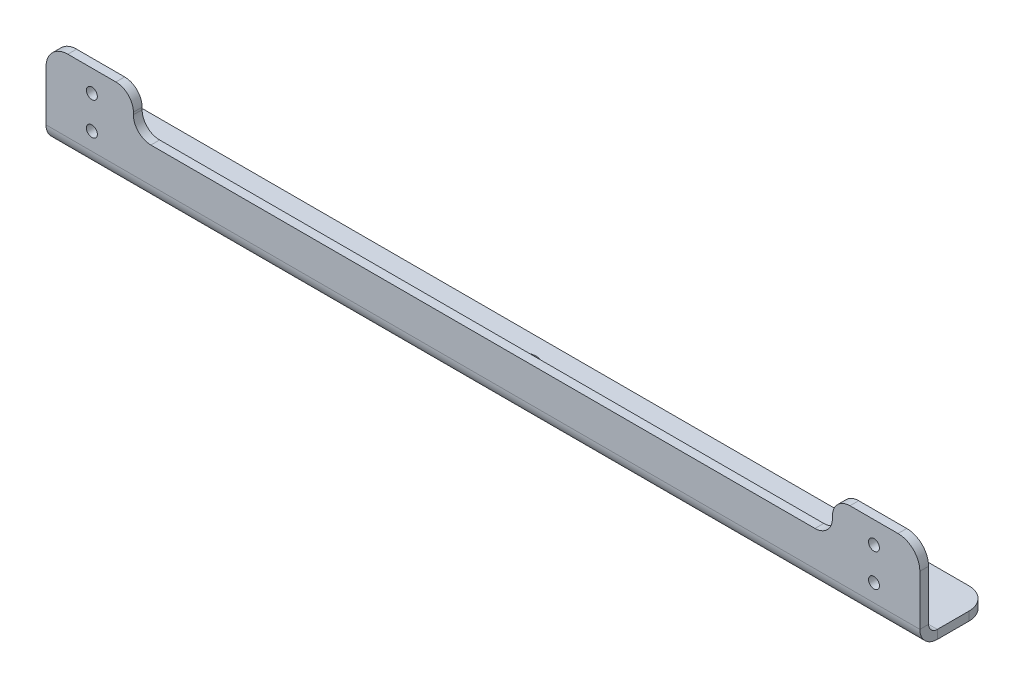
ISO-10303-21;
HEADER;
FILE_DESCRIPTION(('STEP AP214'),'2;1');
FILE_NAME('part.step','',(''),(''),'','','');
FILE_SCHEMA(('AUTOMOTIVE_DESIGN { 1 0 10303 214 1 1 1 1 }'));
ENDSEC;
DATA;
#1=APPLICATION_CONTEXT('core data for automotive mechanical design processes');
#2=APPLICATION_PROTOCOL_DEFINITION('international standard','automotive_design',2000,#1);
#3=PRODUCT_CONTEXT('',#1,'mechanical');
#4=PRODUCT('Part','Part','',(#3));
#5=PRODUCT_RELATED_PRODUCT_CATEGORY('part','',(#4));
#6=PRODUCT_DEFINITION_FORMATION('','',#4);
#7=PRODUCT_DEFINITION_CONTEXT('part definition',#1,'design');
#8=PRODUCT_DEFINITION('design','',#6,#7);
#9=PRODUCT_DEFINITION_SHAPE('','',#8);
#10=(LENGTH_UNIT() NAMED_UNIT(*) SI_UNIT(.MILLI.,.METRE.));
#11=(NAMED_UNIT(*) PLANE_ANGLE_UNIT() SI_UNIT($,.RADIAN.));
#12=(NAMED_UNIT(*) SI_UNIT($,.STERADIAN.) SOLID_ANGLE_UNIT());
#13=UNCERTAINTY_MEASURE_WITH_UNIT(LENGTH_MEASURE(1.E-05),#10,'distance_accuracy_value','');
#14=(GEOMETRIC_REPRESENTATION_CONTEXT(3) GLOBAL_UNCERTAINTY_ASSIGNED_CONTEXT((#13)) GLOBAL_UNIT_ASSIGNED_CONTEXT((#10,
#11,#12)) REPRESENTATION_CONTEXT('',''));
#15=CARTESIAN_POINT('',(0.,0.,0.));
#16=DIRECTION('',(0.,0.,1.));
#17=DIRECTION('',(1.,0.,0.));
#18=AXIS2_PLACEMENT_3D('',#15,#16,#17);
#19=CARTESIAN_POINT('',(-200.,-18.500000001664,-0.249999999999937));
#20=DIRECTION('',(-1.,0.,0.));
#21=DIRECTION('',(0.,1.,0.));
#22=AXIS2_PLACEMENT_3D('',#19,#20,#21);
#23=PLANE('',#22);
#24=DIRECTION('',(0.,1.,0.));
#25=VECTOR('',#24,1.);
#26=CARTESIAN_POINT('',(-200.,-18.500000001664,-4.24999999999994));
#27=LINE('',#26,#25);
#28=CARTESIAN_POINT('',(-200.,4.00000000000001,-4.25000000000002));
#29=VERTEX_POINT('',#28);
#30=CARTESIAN_POINT('',(-200.,26.999999998336,-4.2500000000001));
#31=VERTEX_POINT('',#30);
#32=EDGE_CURVE('E72',#29,#31,#27,.T.);
#33=ORIENTED_EDGE('',*,*,#32,.F.);
#34=DIRECTION('',(0.,0.,1.));
#35=VECTOR('',#34,1.);
#36=CARTESIAN_POINT('',(-200.,4.00000000000003,-0.250000000000018));
#37=LINE('',#36,#35);
#38=CARTESIAN_POINT('',(-200.,4.00000000000002,-0.250000000000014));
#39=VERTEX_POINT('',#38);
#40=EDGE_CURVE('E185',#29,#39,#37,.T.);
#41=ORIENTED_EDGE('',*,*,#40,.T.);
#42=DIRECTION('',(0.,1.,0.));
#43=VECTOR('',#42,1.);
#44=CARTESIAN_POINT('',(-200.,-18.500000001664,-0.249999999999937));
#45=LINE('',#44,#43);
#46=CARTESIAN_POINT('',(-200.,26.999999998336,-0.250000000000096));
#47=VERTEX_POINT('',#46);
#48=EDGE_CURVE('E51',#39,#47,#45,.T.);
#49=ORIENTED_EDGE('',*,*,#48,.T.);
#50=DIRECTION('',(0.,0.,-1.));
#51=VECTOR('',#50,1.);
#52=CARTESIAN_POINT('',(-200.,26.999999998336,-0.250000000000096));
#53=LINE('',#52,#51);
#54=EDGE_CURVE('E216',#47,#31,#53,.T.);
#55=ORIENTED_EDGE('',*,*,#54,.T.);
#56=EDGE_LOOP('',(#33,#41,#49,#55));
#57=FACE_BOUND('',#56,.T.);
#58=ADVANCED_FACE('F47',(#57),#23,.T.);
#59=CARTESIAN_POINT('',(200.,-18.500000001664,-0.249999999999937));
#60=DIRECTION('',(1.,0.,0.));
#61=DIRECTION('',(0.,-1.,0.));
#62=AXIS2_PLACEMENT_3D('',#59,#60,#61);
#63=PLANE('',#62);
#64=DIRECTION('',(0.,-1.,0.));
#65=VECTOR('',#64,1.);
#66=CARTESIAN_POINT('',(200.,-18.500000001664,-0.249999999999937));
#67=LINE('',#66,#65);
#68=CARTESIAN_POINT('',(200.,26.999999998336,-0.250000000000096));
#69=VERTEX_POINT('',#68);
#70=CARTESIAN_POINT('',(200.,4.00000000000003,-0.250000000000016));
#71=VERTEX_POINT('',#70);
#72=EDGE_CURVE('E206',#69,#71,#67,.T.);
#73=ORIENTED_EDGE('',*,*,#72,.T.);
#74=DIRECTION('',(0.,0.,-1.));
#75=VECTOR('',#74,1.);
#76=CARTESIAN_POINT('',(200.,4.00000000000003,-0.250000000000018));
#77=LINE('',#76,#75);
#78=CARTESIAN_POINT('',(200.,4.00000000000001,-4.25000000000002));
#79=VERTEX_POINT('',#78);
#80=EDGE_CURVE('E12',#71,#79,#77,.T.);
#81=ORIENTED_EDGE('',*,*,#80,.T.);
#82=DIRECTION('',(0.,-1.,0.));
#83=VECTOR('',#82,1.);
#84=CARTESIAN_POINT('',(200.,-18.500000001664,-4.24999999999994));
#85=LINE('',#84,#83);
#86=CARTESIAN_POINT('',(200.,26.999999998336,-4.2500000000001));
#87=VERTEX_POINT('',#86);
#88=EDGE_CURVE('E65',#87,#79,#85,.T.);
#89=ORIENTED_EDGE('',*,*,#88,.F.);
#90=DIRECTION('',(0.,0.,-1.));
#91=VECTOR('',#90,1.);
#92=CARTESIAN_POINT('',(200.,26.999999998336,-0.250000000000096));
#93=LINE('',#92,#91);
#94=EDGE_CURVE('E386',#69,#87,#93,.T.);
#95=ORIENTED_EDGE('',*,*,#94,.F.);
#96=EDGE_LOOP('',(#73,#81,#89,#95));
#97=FACE_BOUND('',#96,.T.);
#98=ADVANCED_FACE('F49',(#97),#63,.T.);
#99=CARTESIAN_POINT('',(-190.,26.999999998336,-4.2500000000001));
#100=DIRECTION('',(0.,0.,-1.));
#101=DIRECTION('',(0.,1.,0.));
#102=AXIS2_PLACEMENT_3D('',#99,#100,#101);
#103=PLANE('',#102);
#104=CARTESIAN_POINT('',(179.,11.999999998336,-4.25000000000004));
#105=DIRECTION('',(0.,0.,-1.));
#106=DIRECTION('',(0.,-1.,0.));
#107=AXIS2_PLACEMENT_3D('',#104,#105,#106);
#108=CIRCLE('',#107,2.5);
#109=CARTESIAN_POINT('',(179.,9.49999999833596,-4.25000000000003));
#110=VERTEX_POINT('',#109);
#111=EDGE_CURVE('E524',#110,#110,#108,.T.);
#112=ORIENTED_EDGE('',*,*,#111,.F.);
#113=EDGE_LOOP('',(#112));
#114=FACE_BOUND('',#113,.T.);
#115=CARTESIAN_POINT('',(179.,26.999999998336,-4.2500000000001));
#116=DIRECTION('',(0.,0.,-1.));
#117=DIRECTION('',(0.,-1.,0.));
#118=AXIS2_PLACEMENT_3D('',#115,#116,#117);
#119=CIRCLE('',#118,2.5);
#120=CARTESIAN_POINT('',(179.,24.499999998336,-4.25000000000009));
#121=VERTEX_POINT('',#120);
#122=EDGE_CURVE('E528',#121,#121,#119,.T.);
#123=ORIENTED_EDGE('',*,*,#122,.F.);
#124=EDGE_LOOP('',(#123));
#125=FACE_BOUND('',#124,.T.);
#126=CARTESIAN_POINT('',(-179.,26.999999998336,-4.2500000000001));
#127=DIRECTION('',(0.,0.,-1.));
#128=DIRECTION('',(0.,1.,0.));
#129=AXIS2_PLACEMENT_3D('',#126,#127,#128);
#130=CIRCLE('',#129,2.5);
#131=CARTESIAN_POINT('',(-179.,29.499999998336,-4.25000000000011));
#132=VERTEX_POINT('',#131);
#133=EDGE_CURVE('E532',#132,#132,#130,.T.);
#134=ORIENTED_EDGE('',*,*,#133,.F.);
#135=EDGE_LOOP('',(#134));
#136=FACE_BOUND('',#135,.T.);
#137=CARTESIAN_POINT('',(-179.,11.999999998336,-4.25000000000004));
#138=DIRECTION('',(0.,0.,-1.));
#139=DIRECTION('',(0.,1.,0.));
#140=AXIS2_PLACEMENT_3D('',#137,#138,#139);
#141=CIRCLE('',#140,2.5);
#142=CARTESIAN_POINT('',(-179.,14.499999998336,-4.25000000000005));
#143=VERTEX_POINT('',#142);
#144=EDGE_CURVE('E535',#143,#143,#141,.T.);
#145=ORIENTED_EDGE('',*,*,#144,.F.);
#146=EDGE_LOOP('',(#145));
#147=FACE_BOUND('',#146,.T.);
#148=ORIENTED_EDGE('',*,*,#88,.T.);
#149=DIRECTION('',(-1.,0.,0.));
#150=VECTOR('',#149,1.);
#151=CARTESIAN_POINT('',(-190.,4.00000000000001,-4.25000000000002));
#152=LINE('',#151,#150);
#153=EDGE_CURVE('E57',#79,#29,#152,.T.);
#154=ORIENTED_EDGE('',*,*,#153,.T.);
#155=ORIENTED_EDGE('',*,*,#32,.T.);
#156=CARTESIAN_POINT('',(-190.,26.999999998336,-4.2500000000001));
#157=DIRECTION('',(0.,0.,-1.));
#158=DIRECTION('',(0.,1.,0.));
#159=AXIS2_PLACEMENT_3D('',#156,#157,#158);
#160=CIRCLE('',#159,10.);
#161=CARTESIAN_POINT('',(-190.,36.999999998336,-4.25000000000013));
#162=VERTEX_POINT('',#161);
#163=EDGE_CURVE('E245',#31,#162,#160,.T.);
#164=ORIENTED_EDGE('',*,*,#163,.T.);
#165=DIRECTION('',(1.,0.,0.));
#166=VECTOR('',#165,1.);
#167=CARTESIAN_POINT('',(-190.,36.999999998336,-4.25000000000013));
#168=LINE('',#167,#166);
#169=CARTESIAN_POINT('',(-168.,36.999999998336,-4.25000000000013));
#170=VERTEX_POINT('',#169);
#171=EDGE_CURVE('E345',#162,#170,#168,.T.);
#172=ORIENTED_EDGE('',*,*,#171,.T.);
#173=CARTESIAN_POINT('',(-168.,28.999999998336,-4.2500000000001));
#174=DIRECTION('',(0.,0.,-1.));
#175=DIRECTION('',(0.,1.,0.));
#176=AXIS2_PLACEMENT_3D('',#173,#174,#175);
#177=CIRCLE('',#176,7.99999999999999);
#178=CARTESIAN_POINT('',(-160.,28.999999998336,-4.2500000000001));
#179=VERTEX_POINT('',#178);
#180=EDGE_CURVE('E349',#170,#179,#177,.T.);
#181=ORIENTED_EDGE('',*,*,#180,.T.);
#182=DIRECTION('',(0.,-1.,0.));
#183=VECTOR('',#182,1.);
#184=CARTESIAN_POINT('',(-160.,28.999999998336,-4.2500000000001));
#185=LINE('',#184,#183);
#186=CARTESIAN_POINT('',(-160.,27.999999998336,-4.2500000000001));
#187=VERTEX_POINT('',#186);
#188=EDGE_CURVE('E353',#179,#187,#185,.T.);
#189=ORIENTED_EDGE('',*,*,#188,.T.);
#190=CARTESIAN_POINT('',(-152.,27.999999998336,-4.2500000000001));
#191=DIRECTION('',(0.,0.,1.));
#192=DIRECTION('',(0.,-1.,0.));
#193=AXIS2_PLACEMENT_3D('',#190,#191,#192);
#194=CIRCLE('',#193,7.99999999999999);
#195=CARTESIAN_POINT('',(-152.,19.999999998336,-4.25000000000007));
#196=VERTEX_POINT('',#195);
#197=EDGE_CURVE('E357',#187,#196,#194,.T.);
#198=ORIENTED_EDGE('',*,*,#197,.T.);
#199=DIRECTION('',(1.,0.,0.));
#200=VECTOR('',#199,1.);
#201=CARTESIAN_POINT('',(-152.,19.999999998336,-4.25000000000007));
#202=LINE('',#201,#200);
#203=CARTESIAN_POINT('',(152.,19.999999998336,-4.25000000000007));
#204=VERTEX_POINT('',#203);
#205=EDGE_CURVE('E361',#196,#204,#202,.T.);
#206=ORIENTED_EDGE('',*,*,#205,.T.);
#207=CARTESIAN_POINT('',(152.,27.999999998336,-4.2500000000001));
#208=DIRECTION('',(0.,0.,1.));
#209=DIRECTION('',(0.,-1.,0.));
#210=AXIS2_PLACEMENT_3D('',#207,#208,#209);
#211=CIRCLE('',#210,8.00000000000002);
#212=CARTESIAN_POINT('',(160.,27.999999998336,-4.2500000000001));
#213=VERTEX_POINT('',#212);
#214=EDGE_CURVE('E365',#204,#213,#211,.T.);
#215=ORIENTED_EDGE('',*,*,#214,.T.);
#216=DIRECTION('',(0.,1.,0.));
#217=VECTOR('',#216,1.);
#218=CARTESIAN_POINT('',(160.,28.999999998336,-4.2500000000001));
#219=LINE('',#218,#217);
#220=CARTESIAN_POINT('',(160.,28.999999998336,-4.2500000000001));
#221=VERTEX_POINT('',#220);
#222=EDGE_CURVE('E369',#213,#221,#219,.T.);
#223=ORIENTED_EDGE('',*,*,#222,.T.);
#224=CARTESIAN_POINT('',(168.,28.999999998336,-4.2500000000001));
#225=DIRECTION('',(0.,0.,-1.));
#226=DIRECTION('',(0.,-1.,0.));
#227=AXIS2_PLACEMENT_3D('',#224,#225,#226);
#228=CIRCLE('',#227,8.);
#229=CARTESIAN_POINT('',(168.,36.999999998336,-4.25000000000013));
#230=VERTEX_POINT('',#229);
#231=EDGE_CURVE('E373',#221,#230,#228,.T.);
#232=ORIENTED_EDGE('',*,*,#231,.T.);
#233=DIRECTION('',(1.,0.,0.));
#234=VECTOR('',#233,1.);
#235=CARTESIAN_POINT('',(168.,36.999999998336,-4.25000000000013));
#236=LINE('',#235,#234);
#237=CARTESIAN_POINT('',(190.,36.999999998336,-4.25000000000013));
#238=VERTEX_POINT('',#237);
#239=EDGE_CURVE('E377',#230,#238,#236,.T.);
#240=ORIENTED_EDGE('',*,*,#239,.T.);
#241=CARTESIAN_POINT('',(190.,26.999999998336,-4.2500000000001));
#242=DIRECTION('',(0.,0.,-1.));
#243=DIRECTION('',(0.,1.,0.));
#244=AXIS2_PLACEMENT_3D('',#241,#242,#243);
#245=CIRCLE('',#244,10.);
#246=EDGE_CURVE('E381',#238,#87,#245,.T.);
#247=ORIENTED_EDGE('',*,*,#246,.T.);
#248=EDGE_LOOP('',(#148,#154,#155,#164,#172,#181,#189,#198,#206,#215,#223,#232,#240,#247));
#249=FACE_BOUND('',#248,.T.);
#250=ADVANCED_FACE('F424',(#114,#125,#136,#147,#249),#103,.T.);
#251=CARTESIAN_POINT('',(-190.,26.999999998336,-0.250000000000096));
#252=DIRECTION('',(0.,0.,-1.));
#253=DIRECTION('',(0.,1.,0.));
#254=AXIS2_PLACEMENT_3D('',#251,#252,#253);
#255=CYLINDRICAL_SURFACE('',#254,10.);
#256=ORIENTED_EDGE('',*,*,#163,.F.);
#257=ORIENTED_EDGE('',*,*,#54,.F.);
#258=CARTESIAN_POINT('',(-190.,26.999999998336,-0.250000000000096));
#259=DIRECTION('',(0.,0.,-1.));
#260=DIRECTION('',(0.,1.,0.));
#261=AXIS2_PLACEMENT_3D('',#258,#259,#260);
#262=CIRCLE('',#261,10.);
#263=CARTESIAN_POINT('',(-190.,36.999999998336,-0.250000000000131));
#264=VERTEX_POINT('',#263);
#265=EDGE_CURVE('E203',#47,#264,#262,.T.);
#266=ORIENTED_EDGE('',*,*,#265,.T.);
#267=DIRECTION('',(0.,0.,-1.));
#268=VECTOR('',#267,1.);
#269=CARTESIAN_POINT('',(-190.,36.999999998336,-0.250000000000131));
#270=LINE('',#269,#268);
#271=EDGE_CURVE('E205',#264,#162,#270,.T.);
#272=ORIENTED_EDGE('',*,*,#271,.T.);
#273=EDGE_LOOP('',(#256,#257,#266,#272));
#274=FACE_BOUND('',#273,.T.);
#275=ADVANCED_FACE('F428',(#274),#255,.T.);
#276=CARTESIAN_POINT('',(190.,26.999999998336,-0.250000000000096));
#277=DIRECTION('',(0.,0.,-1.));
#278=DIRECTION('',(0.,1.,0.));
#279=AXIS2_PLACEMENT_3D('',#276,#277,#278);
#280=CYLINDRICAL_SURFACE('',#279,10.);
#281=ORIENTED_EDGE('',*,*,#246,.F.);
#282=DIRECTION('',(0.,0.,-1.));
#283=VECTOR('',#282,1.);
#284=CARTESIAN_POINT('',(190.,36.999999998336,-0.250000000000131));
#285=LINE('',#284,#283);
#286=CARTESIAN_POINT('',(190.,36.999999998336,-0.250000000000131));
#287=VERTEX_POINT('',#286);
#288=EDGE_CURVE('E389',#287,#238,#285,.T.);
#289=ORIENTED_EDGE('',*,*,#288,.F.);
#290=CARTESIAN_POINT('',(190.,26.999999998336,-0.250000000000096));
#291=DIRECTION('',(0.,0.,-1.));
#292=DIRECTION('',(0.,1.,0.));
#293=AXIS2_PLACEMENT_3D('',#290,#291,#292);
#294=CIRCLE('',#293,10.);
#295=EDGE_CURVE('E338',#287,#69,#294,.T.);
#296=ORIENTED_EDGE('',*,*,#295,.T.);
#297=ORIENTED_EDGE('',*,*,#94,.T.);
#298=EDGE_LOOP('',(#281,#289,#296,#297));
#299=FACE_BOUND('',#298,.T.);
#300=ADVANCED_FACE('F467',(#299),#280,.T.);
#301=CARTESIAN_POINT('',(168.,36.999999998336,-0.250000000000131));
#302=DIRECTION('',(0.,1.,0.));
#303=DIRECTION('',(1.,0.,0.));
#304=AXIS2_PLACEMENT_3D('',#301,#302,#303);
#305=PLANE('',#304);
#306=ORIENTED_EDGE('',*,*,#239,.F.);
#307=DIRECTION('',(0.,0.,-1.));
#308=VECTOR('',#307,1.);
#309=CARTESIAN_POINT('',(168.,36.999999998336,-0.250000000000131));
#310=LINE('',#309,#308);
#311=CARTESIAN_POINT('',(168.,36.999999998336,-0.250000000000131));
#312=VERTEX_POINT('',#311);
#313=EDGE_CURVE('E392',#312,#230,#310,.T.);
#314=ORIENTED_EDGE('',*,*,#313,.F.);
#315=DIRECTION('',(1.,0.,0.));
#316=VECTOR('',#315,1.);
#317=CARTESIAN_POINT('',(168.,36.999999998336,-0.250000000000131));
#318=LINE('',#317,#316);
#319=EDGE_CURVE('E334',#312,#287,#318,.T.);
#320=ORIENTED_EDGE('',*,*,#319,.T.);
#321=ORIENTED_EDGE('',*,*,#288,.T.);
#322=EDGE_LOOP('',(#306,#314,#320,#321));
#323=FACE_BOUND('',#322,.T.);
#324=ADVANCED_FACE('F463',(#323),#305,.T.);
#325=CARTESIAN_POINT('',(168.,28.999999998336,-0.250000000000103));
#326=DIRECTION('',(0.,0.,-1.));
#327=DIRECTION('',(0.,1.,0.));
#328=AXIS2_PLACEMENT_3D('',#325,#326,#327);
#329=CYLINDRICAL_SURFACE('',#328,8.);
#330=ORIENTED_EDGE('',*,*,#231,.F.);
#331=DIRECTION('',(0.,0.,-1.));
#332=VECTOR('',#331,1.);
#333=CARTESIAN_POINT('',(160.,28.999999998336,-0.250000000000103));
#334=LINE('',#333,#332);
#335=CARTESIAN_POINT('',(160.,28.999999998336,-0.250000000000103));
#336=VERTEX_POINT('',#335);
#337=EDGE_CURVE('E395',#336,#221,#334,.T.);
#338=ORIENTED_EDGE('',*,*,#337,.F.);
#339=CARTESIAN_POINT('',(168.,28.999999998336,-0.250000000000103));
#340=DIRECTION('',(0.,0.,-1.));
#341=DIRECTION('',(0.,-1.,0.));
#342=AXIS2_PLACEMENT_3D('',#339,#340,#341);
#343=CIRCLE('',#342,8.);
#344=EDGE_CURVE('E330',#336,#312,#343,.T.);
#345=ORIENTED_EDGE('',*,*,#344,.T.);
#346=ORIENTED_EDGE('',*,*,#313,.T.);
#347=EDGE_LOOP('',(#330,#338,#345,#346));
#348=FACE_BOUND('',#347,.T.);
#349=ADVANCED_FACE('F459',(#348),#329,.T.);
#350=CARTESIAN_POINT('',(160.,28.999999998336,-0.250000000000103));
#351=DIRECTION('',(-1.,0.,0.));
#352=DIRECTION('',(0.,1.,0.));
#353=AXIS2_PLACEMENT_3D('',#350,#351,#352);
#354=PLANE('',#353);
#355=ORIENTED_EDGE('',*,*,#222,.F.);
#356=DIRECTION('',(0.,0.,-1.));
#357=VECTOR('',#356,1.);
#358=CARTESIAN_POINT('',(160.,27.999999998336,-0.2500000000001));
#359=LINE('',#358,#357);
#360=CARTESIAN_POINT('',(160.,27.999999998336,-0.2500000000001));
#361=VERTEX_POINT('',#360);
#362=EDGE_CURVE('E398',#361,#213,#359,.T.);
#363=ORIENTED_EDGE('',*,*,#362,.F.);
#364=DIRECTION('',(0.,1.,0.));
#365=VECTOR('',#364,1.);
#366=CARTESIAN_POINT('',(160.,28.999999998336,-0.250000000000103));
#367=LINE('',#366,#365);
#368=EDGE_CURVE('E326',#361,#336,#367,.T.);
#369=ORIENTED_EDGE('',*,*,#368,.T.);
#370=ORIENTED_EDGE('',*,*,#337,.T.);
#371=EDGE_LOOP('',(#355,#363,#369,#370));
#372=FACE_BOUND('',#371,.T.);
#373=ADVANCED_FACE('F455',(#372),#354,.T.);
#374=CARTESIAN_POINT('',(152.,27.999999998336,-0.2500000000001));
#375=DIRECTION('',(0.,0.,-1.));
#376=DIRECTION('',(0.,1.,0.));
#377=AXIS2_PLACEMENT_3D('',#374,#375,#376);
#378=CYLINDRICAL_SURFACE('',#377,8.00000000000002);
#379=ORIENTED_EDGE('',*,*,#214,.F.);
#380=DIRECTION('',(0.,0.,-1.));
#381=VECTOR('',#380,1.);
#382=CARTESIAN_POINT('',(152.,19.999999998336,-0.250000000000071));
#383=LINE('',#382,#381);
#384=CARTESIAN_POINT('',(152.,19.999999998336,-0.250000000000071));
#385=VERTEX_POINT('',#384);
#386=EDGE_CURVE('E401',#385,#204,#383,.T.);
#387=ORIENTED_EDGE('',*,*,#386,.F.);
#388=CARTESIAN_POINT('',(152.,27.999999998336,-0.2500000000001));
#389=DIRECTION('',(0.,0.,1.));
#390=DIRECTION('',(0.,-1.,0.));
#391=AXIS2_PLACEMENT_3D('',#388,#389,#390);
#392=CIRCLE('',#391,8.00000000000002);
#393=EDGE_CURVE('E322',#385,#361,#392,.T.);
#394=ORIENTED_EDGE('',*,*,#393,.T.);
#395=ORIENTED_EDGE('',*,*,#362,.T.);
#396=EDGE_LOOP('',(#379,#387,#394,#395));
#397=FACE_BOUND('',#396,.T.);
#398=ADVANCED_FACE('F451',(#397),#378,.F.);
#399=CARTESIAN_POINT('',(-152.,19.999999998336,-0.250000000000071));
#400=DIRECTION('',(0.,1.,0.));
#401=DIRECTION('',(1.,0.,0.));
#402=AXIS2_PLACEMENT_3D('',#399,#400,#401);
#403=PLANE('',#402);
#404=ORIENTED_EDGE('',*,*,#205,.F.);
#405=DIRECTION('',(0.,0.,-1.));
#406=VECTOR('',#405,1.);
#407=CARTESIAN_POINT('',(-152.,19.999999998336,-0.250000000000071));
#408=LINE('',#407,#406);
#409=CARTESIAN_POINT('',(-152.,19.999999998336,-0.250000000000071));
#410=VERTEX_POINT('',#409);
#411=EDGE_CURVE('E404',#410,#196,#408,.T.);
#412=ORIENTED_EDGE('',*,*,#411,.F.);
#413=DIRECTION('',(1.,0.,0.));
#414=VECTOR('',#413,1.);
#415=CARTESIAN_POINT('',(-152.,19.999999998336,-0.250000000000071));
#416=LINE('',#415,#414);
#417=EDGE_CURVE('E318',#410,#385,#416,.T.);
#418=ORIENTED_EDGE('',*,*,#417,.T.);
#419=ORIENTED_EDGE('',*,*,#386,.T.);
#420=EDGE_LOOP('',(#404,#412,#418,#419));
#421=FACE_BOUND('',#420,.T.);
#422=ADVANCED_FACE('F447',(#421),#403,.T.);
#423=CARTESIAN_POINT('',(-152.,27.999999998336,-0.2500000000001));
#424=DIRECTION('',(0.,0.,-1.));
#425=DIRECTION('',(0.,1.,0.));
#426=AXIS2_PLACEMENT_3D('',#423,#424,#425);
#427=CYLINDRICAL_SURFACE('',#426,7.99999999999999);
#428=ORIENTED_EDGE('',*,*,#197,.F.);
#429=DIRECTION('',(0.,0.,-1.));
#430=VECTOR('',#429,1.);
#431=CARTESIAN_POINT('',(-160.,27.999999998336,-0.2500000000001));
#432=LINE('',#431,#430);
#433=CARTESIAN_POINT('',(-160.,27.999999998336,-0.2500000000001));
#434=VERTEX_POINT('',#433);
#435=EDGE_CURVE('E407',#434,#187,#432,.T.);
#436=ORIENTED_EDGE('',*,*,#435,.F.);
#437=CARTESIAN_POINT('',(-152.,27.999999998336,-0.2500000000001));
#438=DIRECTION('',(0.,0.,1.));
#439=DIRECTION('',(0.,-1.,0.));
#440=AXIS2_PLACEMENT_3D('',#437,#438,#439);
#441=CIRCLE('',#440,7.99999999999999);
#442=EDGE_CURVE('E314',#434,#410,#441,.T.);
#443=ORIENTED_EDGE('',*,*,#442,.T.);
#444=ORIENTED_EDGE('',*,*,#411,.T.);
#445=EDGE_LOOP('',(#428,#436,#443,#444));
#446=FACE_BOUND('',#445,.T.);
#447=ADVANCED_FACE('F443',(#446),#427,.F.);
#448=CARTESIAN_POINT('',(-160.,28.999999998336,-0.250000000000103));
#449=DIRECTION('',(1.,0.,0.));
#450=DIRECTION('',(0.,-1.,0.));
#451=AXIS2_PLACEMENT_3D('',#448,#449,#450);
#452=PLANE('',#451);
#453=ORIENTED_EDGE('',*,*,#188,.F.);
#454=DIRECTION('',(0.,0.,-1.));
#455=VECTOR('',#454,1.);
#456=CARTESIAN_POINT('',(-160.,28.999999998336,-0.250000000000103));
#457=LINE('',#456,#455);
#458=CARTESIAN_POINT('',(-160.,28.999999998336,-0.250000000000103));
#459=VERTEX_POINT('',#458);
#460=EDGE_CURVE('E410',#459,#179,#457,.T.);
#461=ORIENTED_EDGE('',*,*,#460,.F.);
#462=DIRECTION('',(0.,-1.,0.));
#463=VECTOR('',#462,1.);
#464=CARTESIAN_POINT('',(-160.,28.999999998336,-0.250000000000103));
#465=LINE('',#464,#463);
#466=EDGE_CURVE('E310',#459,#434,#465,.T.);
#467=ORIENTED_EDGE('',*,*,#466,.T.);
#468=ORIENTED_EDGE('',*,*,#435,.T.);
#469=EDGE_LOOP('',(#453,#461,#467,#468));
#470=FACE_BOUND('',#469,.T.);
#471=ADVANCED_FACE('F439',(#470),#452,.T.);
#472=CARTESIAN_POINT('',(-168.,28.999999998336,-0.250000000000103));
#473=DIRECTION('',(0.,0.,-1.));
#474=DIRECTION('',(0.,1.,0.));
#475=AXIS2_PLACEMENT_3D('',#472,#473,#474);
#476=CYLINDRICAL_SURFACE('',#475,7.99999999999999);
#477=ORIENTED_EDGE('',*,*,#180,.F.);
#478=DIRECTION('',(0.,0.,-1.));
#479=VECTOR('',#478,1.);
#480=CARTESIAN_POINT('',(-168.,36.999999998336,-0.250000000000131));
#481=LINE('',#480,#479);
#482=CARTESIAN_POINT('',(-168.,36.999999998336,-0.250000000000131));
#483=VERTEX_POINT('',#482);
#484=EDGE_CURVE('E413',#483,#170,#481,.T.);
#485=ORIENTED_EDGE('',*,*,#484,.F.);
#486=CARTESIAN_POINT('',(-168.,28.999999998336,-0.250000000000103));
#487=DIRECTION('',(0.,0.,-1.));
#488=DIRECTION('',(0.,1.,0.));
#489=AXIS2_PLACEMENT_3D('',#486,#487,#488);
#490=CIRCLE('',#489,7.99999999999999);
#491=EDGE_CURVE('E306',#483,#459,#490,.T.);
#492=ORIENTED_EDGE('',*,*,#491,.T.);
#493=ORIENTED_EDGE('',*,*,#460,.T.);
#494=EDGE_LOOP('',(#477,#485,#492,#493));
#495=FACE_BOUND('',#494,.T.);
#496=ADVANCED_FACE('F435',(#495),#476,.T.);
#497=CARTESIAN_POINT('',(-190.,36.999999998336,-0.250000000000131));
#498=DIRECTION('',(0.,1.,0.));
#499=DIRECTION('',(1.,0.,0.));
#500=AXIS2_PLACEMENT_3D('',#497,#498,#499);
#501=PLANE('',#500);
#502=ORIENTED_EDGE('',*,*,#171,.F.);
#503=ORIENTED_EDGE('',*,*,#271,.F.);
#504=DIRECTION('',(1.,0.,0.));
#505=VECTOR('',#504,1.);
#506=CARTESIAN_POINT('',(-190.,36.999999998336,-0.250000000000131));
#507=LINE('',#506,#505);
#508=EDGE_CURVE('E302',#264,#483,#507,.T.);
#509=ORIENTED_EDGE('',*,*,#508,.T.);
#510=ORIENTED_EDGE('',*,*,#484,.T.);
#511=EDGE_LOOP('',(#502,#503,#509,#510));
#512=FACE_BOUND('',#511,.T.);
#513=ADVANCED_FACE('F431',(#512),#501,.T.);
#514=CARTESIAN_POINT('',(-190.,26.999999998336,-0.250000000000096));
#515=DIRECTION('',(0.,0.,-1.));
#516=DIRECTION('',(0.,1.,0.));
#517=AXIS2_PLACEMENT_3D('',#514,#515,#516);
#518=PLANE('',#517);
#519=CARTESIAN_POINT('',(179.,11.999999998336,-0.250000000000044));
#520=DIRECTION('',(0.,0.,-1.));
#521=DIRECTION('',(0.,1.,0.));
#522=AXIS2_PLACEMENT_3D('',#519,#520,#521);
#523=CIRCLE('',#522,2.5);
#524=CARTESIAN_POINT('',(179.,14.499999998336,-0.250000000000053));
#525=VERTEX_POINT('',#524);
#526=EDGE_CURVE('E549',#525,#525,#523,.F.);
#527=ORIENTED_EDGE('',*,*,#526,.F.);
#528=EDGE_LOOP('',(#527));
#529=FACE_BOUND('',#528,.T.);
#530=CARTESIAN_POINT('',(179.,26.999999998336,-0.250000000000096));
#531=DIRECTION('',(0.,0.,-1.));
#532=DIRECTION('',(0.,1.,0.));
#533=AXIS2_PLACEMENT_3D('',#530,#531,#532);
#534=CIRCLE('',#533,2.5);
#535=CARTESIAN_POINT('',(179.,29.499999998336,-0.250000000000105));
#536=VERTEX_POINT('',#535);
#537=EDGE_CURVE('E593',#536,#536,#534,.F.);
#538=ORIENTED_EDGE('',*,*,#537,.F.);
#539=EDGE_LOOP('',(#538));
#540=FACE_BOUND('',#539,.T.);
#541=CARTESIAN_POINT('',(-179.,26.999999998336,-0.250000000000096));
#542=DIRECTION('',(0.,0.,-1.));
#543=DIRECTION('',(0.,1.,0.));
#544=AXIS2_PLACEMENT_3D('',#541,#542,#543);
#545=CIRCLE('',#544,2.5);
#546=CARTESIAN_POINT('',(-179.,29.499999998336,-0.250000000000105));
#547=VERTEX_POINT('',#546);
#548=EDGE_CURVE('E539',#547,#547,#545,.F.);
#549=ORIENTED_EDGE('',*,*,#548,.F.);
#550=EDGE_LOOP('',(#549));
#551=FACE_BOUND('',#550,.T.);
#552=CARTESIAN_POINT('',(-179.,11.999999998336,-0.250000000000044));
#553=DIRECTION('',(0.,0.,-1.));
#554=DIRECTION('',(0.,1.,0.));
#555=AXIS2_PLACEMENT_3D('',#552,#553,#554);
#556=CIRCLE('',#555,2.5);
#557=CARTESIAN_POINT('',(-179.,14.499999998336,-0.250000000000053));
#558=VERTEX_POINT('',#557);
#559=EDGE_CURVE('E538',#558,#558,#556,.F.);
#560=ORIENTED_EDGE('',*,*,#559,.F.);
#561=EDGE_LOOP('',(#560));
#562=FACE_BOUND('',#561,.T.);
#563=DIRECTION('',(-1.,0.,0.));
#564=VECTOR('',#563,1.);
#565=CARTESIAN_POINT('',(-190.,4.00000000000003,-0.250000000000016));
#566=LINE('',#565,#564);
#567=EDGE_CURVE('E193',#71,#39,#566,.T.);
#568=ORIENTED_EDGE('',*,*,#567,.F.);
#569=ORIENTED_EDGE('',*,*,#72,.F.);
#570=ORIENTED_EDGE('',*,*,#295,.F.);
#571=ORIENTED_EDGE('',*,*,#319,.F.);
#572=ORIENTED_EDGE('',*,*,#344,.F.);
#573=ORIENTED_EDGE('',*,*,#368,.F.);
#574=ORIENTED_EDGE('',*,*,#393,.F.);
#575=ORIENTED_EDGE('',*,*,#417,.F.);
#576=ORIENTED_EDGE('',*,*,#442,.F.);
#577=ORIENTED_EDGE('',*,*,#466,.F.);
#578=ORIENTED_EDGE('',*,*,#491,.F.);
#579=ORIENTED_EDGE('',*,*,#508,.F.);
#580=ORIENTED_EDGE('',*,*,#265,.F.);
#581=ORIENTED_EDGE('',*,*,#48,.F.);
#582=EDGE_LOOP('',(#568,#569,#570,#571,#572,#573,#574,#575,#576,#577,#578,#579,#580,#581));
#583=FACE_BOUND('',#582,.T.);
#584=ADVANCED_FACE('F198',(#529,#540,#551,#562,#583),#518,.F.);
#585=CARTESIAN_POINT('',(190.,-4.,-22.75));
#586=DIRECTION('',(0.,1.,0.));
#587=DIRECTION('',(0.,0.,1.));
#588=AXIS2_PLACEMENT_3D('',#585,#586,#587);
#589=CYLINDRICAL_SURFACE('',#588,10.);
#590=CARTESIAN_POINT('',(190.,0.,-22.75));
#591=DIRECTION('',(0.,1.,0.));
#592=DIRECTION('',(0.,0.,-1.));
#593=AXIS2_PLACEMENT_3D('',#590,#591,#592);
#594=CIRCLE('',#593,10.);
#595=CARTESIAN_POINT('',(200.,0.,-22.75));
#596=VERTEX_POINT('',#595);
#597=CARTESIAN_POINT('',(190.,0.,-32.75));
#598=VERTEX_POINT('',#597);
#599=EDGE_CURVE('E260',#596,#598,#594,.T.);
#600=ORIENTED_EDGE('',*,*,#599,.F.);
#601=DIRECTION('',(0.,1.,0.));
#602=VECTOR('',#601,1.);
#603=CARTESIAN_POINT('',(200.,-4.,-22.75));
#604=LINE('',#603,#602);
#605=CARTESIAN_POINT('',(200.,-4.,-22.75));
#606=VERTEX_POINT('',#605);
#607=EDGE_CURVE('E241',#606,#596,#604,.T.);
#608=ORIENTED_EDGE('',*,*,#607,.F.);
#609=CARTESIAN_POINT('',(190.,-4.,-22.75));
#610=DIRECTION('',(0.,1.,0.));
#611=DIRECTION('',(0.,0.,-1.));
#612=AXIS2_PLACEMENT_3D('',#609,#610,#611);
#613=CIRCLE('',#612,10.);
#614=CARTESIAN_POINT('',(190.,-4.,-32.75));
#615=VERTEX_POINT('',#614);
#616=EDGE_CURVE('E291',#606,#615,#613,.T.);
#617=ORIENTED_EDGE('',*,*,#616,.T.);
#618=DIRECTION('',(0.,1.,0.));
#619=VECTOR('',#618,1.);
#620=CARTESIAN_POINT('',(190.,-4.,-32.75));
#621=LINE('',#620,#619);
#622=EDGE_CURVE('E288',#615,#598,#621,.T.);
#623=ORIENTED_EDGE('',*,*,#622,.T.);
#624=EDGE_LOOP('',(#600,#608,#617,#623));
#625=FACE_BOUND('',#624,.T.);
#626=ADVANCED_FACE('F494',(#625),#589,.T.);
#627=CARTESIAN_POINT('',(-190.,-4.,-32.75));
#628=DIRECTION('',(0.,0.,-1.));
#629=DIRECTION('',(-1.,0.,0.));
#630=AXIS2_PLACEMENT_3D('',#627,#628,#629);
#631=PLANE('',#630);
#632=DIRECTION('',(-1.,0.,0.));
#633=VECTOR('',#632,1.);
#634=CARTESIAN_POINT('',(-190.,0.,-32.75));
#635=LINE('',#634,#633);
#636=CARTESIAN_POINT('',(-190.,0.,-32.75));
#637=VERTEX_POINT('',#636);
#638=EDGE_CURVE('E256',#598,#637,#635,.T.);
#639=ORIENTED_EDGE('',*,*,#638,.F.);
#640=ORIENTED_EDGE('',*,*,#622,.F.);
#641=DIRECTION('',(-1.,0.,0.));
#642=VECTOR('',#641,1.);
#643=CARTESIAN_POINT('',(-190.,-4.,-32.75));
#644=LINE('',#643,#642);
#645=CARTESIAN_POINT('',(-190.,-4.,-32.75));
#646=VERTEX_POINT('',#645);
#647=EDGE_CURVE('E284',#615,#646,#644,.T.);
#648=ORIENTED_EDGE('',*,*,#647,.T.);
#649=DIRECTION('',(0.,1.,0.));
#650=VECTOR('',#649,1.);
#651=CARTESIAN_POINT('',(-190.,-4.,-32.75));
#652=LINE('',#651,#650);
#653=EDGE_CURVE('E281',#646,#637,#652,.T.);
#654=ORIENTED_EDGE('',*,*,#653,.T.);
#655=EDGE_LOOP('',(#639,#640,#648,#654));
#656=FACE_BOUND('',#655,.T.);
#657=ADVANCED_FACE('F497',(#656),#631,.T.);
#658=CARTESIAN_POINT('',(-190.,-4.,-22.75));
#659=DIRECTION('',(0.,1.,0.));
#660=DIRECTION('',(0.,0.,1.));
#661=AXIS2_PLACEMENT_3D('',#658,#659,#660);
#662=CYLINDRICAL_SURFACE('',#661,10.);
#663=CARTESIAN_POINT('',(-190.,0.,-22.75));
#664=DIRECTION('',(0.,1.,0.));
#665=DIRECTION('',(0.,0.,1.));
#666=AXIS2_PLACEMENT_3D('',#663,#664,#665);
#667=CIRCLE('',#666,10.);
#668=CARTESIAN_POINT('',(-200.,0.,-22.75));
#669=VERTEX_POINT('',#668);
#670=EDGE_CURVE('E252',#637,#669,#667,.T.);
#671=ORIENTED_EDGE('',*,*,#670,.F.);
#672=ORIENTED_EDGE('',*,*,#653,.F.);
#673=CARTESIAN_POINT('',(-190.,-4.,-22.75));
#674=DIRECTION('',(0.,1.,0.));
#675=DIRECTION('',(0.,0.,1.));
#676=AXIS2_PLACEMENT_3D('',#673,#674,#675);
#677=CIRCLE('',#676,10.);
#678=CARTESIAN_POINT('',(-200.,-4.,-22.75));
#679=VERTEX_POINT('',#678);
#680=EDGE_CURVE('E277',#646,#679,#677,.T.);
#681=ORIENTED_EDGE('',*,*,#680,.T.);
#682=DIRECTION('',(0.,1.,0.));
#683=VECTOR('',#682,1.);
#684=CARTESIAN_POINT('',(-200.,-4.,-22.75));
#685=LINE('',#684,#683);
#686=EDGE_CURVE('E274',#679,#669,#685,.T.);
#687=ORIENTED_EDGE('',*,*,#686,.T.);
#688=EDGE_LOOP('',(#671,#672,#681,#687));
#689=FACE_BOUND('',#688,.T.);
#690=ADVANCED_FACE('F499',(#689),#662,.T.);
#691=CARTESIAN_POINT('',(-190.,-4.,22.75));
#692=DIRECTION('',(0.,1.,0.));
#693=DIRECTION('',(0.,0.,1.));
#694=AXIS2_PLACEMENT_3D('',#691,#692,#693);
#695=PLANE('',#694);
#696=CARTESIAN_POINT('',(0.,-4.,-17.75));
#697=DIRECTION('',(0.,1.,0.));
#698=DIRECTION('',(0.,0.,1.));
#699=AXIS2_PLACEMENT_3D('',#696,#697,#698);
#700=CIRCLE('',#699,7.);
#701=CARTESIAN_POINT('',(0.,-4.,-10.75));
#702=VERTEX_POINT('',#701);
#703=EDGE_CURVE('E240',#702,#702,#700,.T.);
#704=ORIENTED_EDGE('',*,*,#703,.T.);
#705=EDGE_LOOP('',(#704));
#706=FACE_BOUND('',#705,.T.);
#707=DIRECTION('',(0.,0.,-1.));
#708=VECTOR('',#707,1.);
#709=CARTESIAN_POINT('',(200.,-4.,-22.75));
#710=LINE('',#709,#708);
#711=CARTESIAN_POINT('',(200.,-4.,-8.25000000000001));
#712=VERTEX_POINT('',#711);
#713=EDGE_CURVE('E246',#712,#606,#710,.T.);
#714=ORIENTED_EDGE('',*,*,#713,.F.);
#715=DIRECTION('',(-1.,0.,0.));
#716=VECTOR('',#715,1.);
#717=CARTESIAN_POINT('',(-190.,-4.,-8.25000000000001));
#718=LINE('',#717,#716);
#719=CARTESIAN_POINT('',(-200.,-4.,-8.25000000000002));
#720=VERTEX_POINT('',#719);
#721=EDGE_CURVE('E270',#712,#720,#718,.T.);
#722=ORIENTED_EDGE('',*,*,#721,.T.);
#723=DIRECTION('',(0.,0.,1.));
#724=VECTOR('',#723,1.);
#725=CARTESIAN_POINT('',(-200.,-4.,-22.75));
#726=LINE('',#725,#724);
#727=EDGE_CURVE('E267',#679,#720,#726,.T.);
#728=ORIENTED_EDGE('',*,*,#727,.F.);
#729=ORIENTED_EDGE('',*,*,#680,.F.);
#730=ORIENTED_EDGE('',*,*,#647,.F.);
#731=ORIENTED_EDGE('',*,*,#616,.F.);
#732=EDGE_LOOP('',(#714,#722,#728,#729,#730,#731));
#733=FACE_BOUND('',#732,.T.);
#734=ADVANCED_FACE('F490',(#706,#733),#695,.F.);
#735=CARTESIAN_POINT('',(-200.,-4.,-22.75));
#736=DIRECTION('',(-1.,0.,0.));
#737=DIRECTION('',(0.,0.,1.));
#738=AXIS2_PLACEMENT_3D('',#735,#736,#737);
#739=PLANE('',#738);
#740=DIRECTION('',(0.,-1.,0.));
#741=VECTOR('',#740,1.);
#742=CARTESIAN_POINT('',(-200.,-4.,-8.25000000000001));
#743=LINE('',#742,#741);
#744=CARTESIAN_POINT('',(-200.,0.,-8.25000000000001));
#745=VERTEX_POINT('',#744);
#746=EDGE_CURVE('E221',#745,#720,#743,.T.);
#747=ORIENTED_EDGE('',*,*,#746,.F.);
#748=DIRECTION('',(0.,0.,1.));
#749=VECTOR('',#748,1.);
#750=CARTESIAN_POINT('',(-200.,0.,-22.75));
#751=LINE('',#750,#749);
#752=EDGE_CURVE('E249',#669,#745,#751,.T.);
#753=ORIENTED_EDGE('',*,*,#752,.F.);
#754=ORIENTED_EDGE('',*,*,#686,.F.);
#755=ORIENTED_EDGE('',*,*,#727,.T.);
#756=EDGE_LOOP('',(#747,#753,#754,#755));
#757=FACE_BOUND('',#756,.T.);
#758=ADVANCED_FACE('F486',(#757),#739,.T.);
#759=CARTESIAN_POINT('',(-190.,0.,22.75));
#760=DIRECTION('',(0.,1.,0.));
#761=DIRECTION('',(0.,0.,1.));
#762=AXIS2_PLACEMENT_3D('',#759,#760,#761);
#763=PLANE('',#762);
#764=CARTESIAN_POINT('',(0.,0.,-17.75));
#765=DIRECTION('',(0.,1.,0.));
#766=DIRECTION('',(0.,0.,1.));
#767=AXIS2_PLACEMENT_3D('',#764,#765,#766);
#768=CIRCLE('',#767,7.);
#769=CARTESIAN_POINT('',(0.,0.,-10.75));
#770=VERTEX_POINT('',#769);
#771=EDGE_CURVE('E544',#770,#770,#768,.T.);
#772=ORIENTED_EDGE('',*,*,#771,.F.);
#773=EDGE_LOOP('',(#772));
#774=FACE_BOUND('',#773,.T.);
#775=DIRECTION('',(-1.,0.,0.));
#776=VECTOR('',#775,1.);
#777=CARTESIAN_POINT('',(-190.,0.,-8.25000000000001));
#778=LINE('',#777,#776);
#779=CARTESIAN_POINT('',(200.,0.,-8.25000000000001));
#780=VERTEX_POINT('',#779);
#781=EDGE_CURVE('E228',#780,#745,#778,.T.);
#782=ORIENTED_EDGE('',*,*,#781,.F.);
#783=DIRECTION('',(0.,0.,-1.));
#784=VECTOR('',#783,1.);
#785=CARTESIAN_POINT('',(200.,0.,-22.75));
#786=LINE('',#785,#784);
#787=EDGE_CURVE('E264',#780,#596,#786,.T.);
#788=ORIENTED_EDGE('',*,*,#787,.T.);
#789=ORIENTED_EDGE('',*,*,#599,.T.);
#790=ORIENTED_EDGE('',*,*,#638,.T.);
#791=ORIENTED_EDGE('',*,*,#670,.T.);
#792=ORIENTED_EDGE('',*,*,#752,.T.);
#793=EDGE_LOOP('',(#782,#788,#789,#790,#791,#792));
#794=FACE_BOUND('',#793,.T.);
#795=ADVANCED_FACE('F482',(#774,#794),#763,.T.);
#796=CARTESIAN_POINT('',(200.,-4.,-22.75));
#797=DIRECTION('',(1.,0.,0.));
#798=DIRECTION('',(0.,0.,-1.));
#799=AXIS2_PLACEMENT_3D('',#796,#797,#798);
#800=PLANE('',#799);
#801=DIRECTION('',(0.,1.,0.));
#802=VECTOR('',#801,1.);
#803=CARTESIAN_POINT('',(200.,-4.,-8.25000000000001));
#804=LINE('',#803,#802);
#805=EDGE_CURVE('E223',#712,#780,#804,.T.);
#806=ORIENTED_EDGE('',*,*,#805,.F.);
#807=ORIENTED_EDGE('',*,*,#713,.T.);
#808=ORIENTED_EDGE('',*,*,#607,.T.);
#809=ORIENTED_EDGE('',*,*,#787,.F.);
#810=EDGE_LOOP('',(#806,#807,#808,#809));
#811=FACE_BOUND('',#810,.T.);
#812=ADVANCED_FACE('F477',(#811),#800,.T.);
#813=CARTESIAN_POINT('',(200.,4.,-8.25000000000001));
#814=DIRECTION('',(1.,0.,0.));
#815=DIRECTION('',(0.,0.,-1.));
#816=AXIS2_PLACEMENT_3D('',#813,#814,#815);
#817=PLANE('',#816);
#818=ORIENTED_EDGE('',*,*,#805,.T.);
#819=CARTESIAN_POINT('',(200.,4.,-8.25000000000001));
#820=DIRECTION('',(-1.,0.,0.));
#821=DIRECTION('',(0.,0.,1.));
#822=AXIS2_PLACEMENT_3D('',#819,#820,#821);
#823=CIRCLE('',#822,4.);
#824=EDGE_CURVE('E236',#780,#79,#823,.T.);
#825=ORIENTED_EDGE('',*,*,#824,.T.);
#826=ORIENTED_EDGE('',*,*,#80,.F.);
#827=CARTESIAN_POINT('',(200.,4.,-8.25000000000001));
#828=DIRECTION('',(-1.,0.,0.));
#829=DIRECTION('',(0.,0.,-1.));
#830=AXIS2_PLACEMENT_3D('',#827,#828,#829);
#831=CIRCLE('',#830,8.);
#832=EDGE_CURVE('E214',#712,#71,#831,.T.);
#833=ORIENTED_EDGE('',*,*,#832,.F.);
#834=EDGE_LOOP('',(#818,#825,#826,#833));
#835=FACE_BOUND('',#834,.T.);
#836=ADVANCED_FACE('F474',(#835),#817,.T.);
#837=CARTESIAN_POINT('',(-200.,4.,-8.25000000000001));
#838=DIRECTION('',(-1.,0.,0.));
#839=DIRECTION('',(0.,0.,1.));
#840=AXIS2_PLACEMENT_3D('',#837,#838,#839);
#841=PLANE('',#840);
#842=ORIENTED_EDGE('',*,*,#40,.F.);
#843=CARTESIAN_POINT('',(-200.,4.,-8.25000000000001));
#844=DIRECTION('',(-1.,0.,0.));
#845=DIRECTION('',(0.,0.,1.));
#846=AXIS2_PLACEMENT_3D('',#843,#844,#845);
#847=CIRCLE('',#846,4.);
#848=EDGE_CURVE('E230',#29,#745,#847,.F.);
#849=ORIENTED_EDGE('',*,*,#848,.T.);
#850=ORIENTED_EDGE('',*,*,#746,.T.);
#851=CARTESIAN_POINT('',(-200.,4.,-8.25000000000001));
#852=DIRECTION('',(1.,0.,0.));
#853=DIRECTION('',(0.,0.,1.));
#854=AXIS2_PLACEMENT_3D('',#851,#852,#853);
#855=CIRCLE('',#854,8.);
#856=EDGE_CURVE('E212',#39,#720,#855,.T.);
#857=ORIENTED_EDGE('',*,*,#856,.F.);
#858=EDGE_LOOP('',(#842,#849,#850,#857));
#859=FACE_BOUND('',#858,.T.);
#860=ADVANCED_FACE('F219',(#859),#841,.T.);
#861=CARTESIAN_POINT('',(400.099987503157,4.,-8.25000000000001));
#862=DIRECTION('',(-1.,0.,0.));
#863=DIRECTION('',(0.,0.,1.));
#864=AXIS2_PLACEMENT_3D('',#861,#862,#863);
#865=CYLINDRICAL_SURFACE('',#864,8.);
#866=ORIENTED_EDGE('',*,*,#856,.T.);
#867=ORIENTED_EDGE('',*,*,#721,.F.);
#868=ORIENTED_EDGE('',*,*,#832,.T.);
#869=ORIENTED_EDGE('',*,*,#567,.T.);
#870=EDGE_LOOP('',(#866,#867,#868,#869));
#871=FACE_BOUND('',#870,.T.);
#872=ADVANCED_FACE('F210',(#871),#865,.T.);
#873=CARTESIAN_POINT('',(400.099987503157,4.,-8.25000000000001));
#874=DIRECTION('',(-1.,0.,0.));
#875=DIRECTION('',(0.,0.,1.));
#876=AXIS2_PLACEMENT_3D('',#873,#874,#875);
#877=CYLINDRICAL_SURFACE('',#876,4.);
#878=ORIENTED_EDGE('',*,*,#848,.F.);
#879=ORIENTED_EDGE('',*,*,#153,.F.);
#880=ORIENTED_EDGE('',*,*,#824,.F.);
#881=ORIENTED_EDGE('',*,*,#781,.T.);
#882=EDGE_LOOP('',(#878,#879,#880,#881));
#883=FACE_BOUND('',#882,.T.);
#884=ADVANCED_FACE('F473',(#883),#877,.F.);
#885=CARTESIAN_POINT('',(0.,-10.,-17.75));
#886=DIRECTION('',(0.,1.,0.));
#887=DIRECTION('',(0.,0.,1.));
#888=AXIS2_PLACEMENT_3D('',#885,#886,#887);
#889=CYLINDRICAL_SURFACE('',#888,7.);
#890=ORIENTED_EDGE('',*,*,#771,.T.);
#891=EDGE_LOOP('',(#890));
#892=FACE_BOUND('',#891,.T.);
#893=ORIENTED_EDGE('',*,*,#703,.F.);
#894=EDGE_LOOP('',(#893));
#895=FACE_BOUND('',#894,.T.);
#896=ADVANCED_FACE('F558',(#892,#895),#889,.F.);
#897=CARTESIAN_POINT('',(-179.,11.999999998336,-0.248999999999926));
#898=DIRECTION('',(0.,0.,-1.));
#899=DIRECTION('',(0.,1.,0.));
#900=AXIS2_PLACEMENT_3D('',#897,#898,#899);
#901=CYLINDRICAL_SURFACE('',#900,2.5);
#902=ORIENTED_EDGE('',*,*,#144,.T.);
#903=EDGE_LOOP('',(#902));
#904=FACE_BOUND('',#903,.T.);
#905=ORIENTED_EDGE('',*,*,#559,.T.);
#906=EDGE_LOOP('',(#905));
#907=FACE_BOUND('',#906,.T.);
#908=ADVANCED_FACE('F560',(#904,#907),#901,.F.);
#909=CARTESIAN_POINT('',(-179.,26.999999998336,-0.248999999999979));
#910=DIRECTION('',(0.,0.,-1.));
#911=DIRECTION('',(0.,1.,0.));
#912=AXIS2_PLACEMENT_3D('',#909,#910,#911);
#913=CYLINDRICAL_SURFACE('',#912,2.5);
#914=ORIENTED_EDGE('',*,*,#133,.T.);
#915=EDGE_LOOP('',(#914));
#916=FACE_BOUND('',#915,.T.);
#917=ORIENTED_EDGE('',*,*,#548,.T.);
#918=EDGE_LOOP('',(#917));
#919=FACE_BOUND('',#918,.T.);
#920=ADVANCED_FACE('F567',(#916,#919),#913,.F.);
#921=CARTESIAN_POINT('',(179.,26.999999998336,-0.248999999999979));
#922=DIRECTION('',(0.,0.,-1.));
#923=DIRECTION('',(0.,1.,0.));
#924=AXIS2_PLACEMENT_3D('',#921,#922,#923);
#925=CYLINDRICAL_SURFACE('',#924,2.5);
#926=ORIENTED_EDGE('',*,*,#122,.T.);
#927=EDGE_LOOP('',(#926));
#928=FACE_BOUND('',#927,.T.);
#929=ORIENTED_EDGE('',*,*,#537,.T.);
#930=EDGE_LOOP('',(#929));
#931=FACE_BOUND('',#930,.T.);
#932=ADVANCED_FACE('F600',(#928,#931),#925,.F.);
#933=CARTESIAN_POINT('',(179.,11.999999998336,-0.248999999999926));
#934=DIRECTION('',(0.,0.,-1.));
#935=DIRECTION('',(0.,1.,0.));
#936=AXIS2_PLACEMENT_3D('',#933,#934,#935);
#937=CYLINDRICAL_SURFACE('',#936,2.5);
#938=ORIENTED_EDGE('',*,*,#111,.T.);
#939=EDGE_LOOP('',(#938));
#940=FACE_BOUND('',#939,.T.);
#941=ORIENTED_EDGE('',*,*,#526,.T.);
#942=EDGE_LOOP('',(#941));
#943=FACE_BOUND('',#942,.T.);
#944=ADVANCED_FACE('F606',(#940,#943),#937,.F.);
#945=CLOSED_SHELL('',(#58,#98,#250,#275,#300,#324,#349,#373,#398,#422,#447,#471,#496,#513,#584,
#626,#657,#690,#734,#758,#795,#812,#836,#860,#872,#884,#896,#908,#920,#932,#944));
#946=MANIFOLD_SOLID_BREP('B2',#945);
#947=ADVANCED_BREP_SHAPE_REPRESENTATION('',(#18,#946),#14);
#948=SHAPE_DEFINITION_REPRESENTATION(#9,#947);
ENDSEC;
END-ISO-10303-21;
